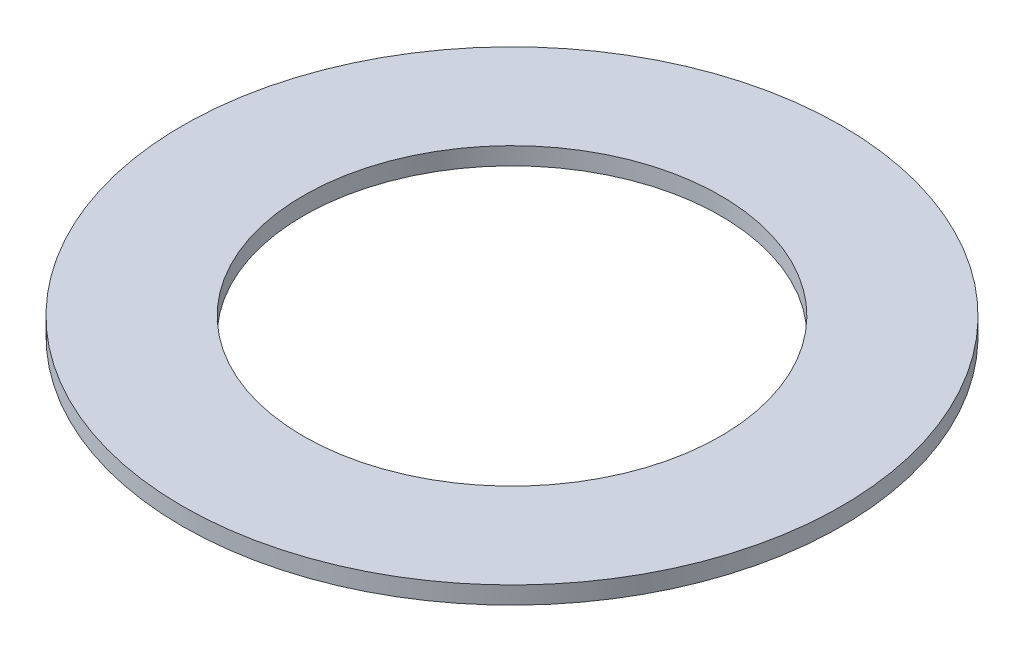
ISO-10303-21;
HEADER;
FILE_DESCRIPTION(('STEP AP214'),'2;1');
FILE_NAME('part.step','',(''),(''),'','','');
FILE_SCHEMA(('AUTOMOTIVE_DESIGN { 1 0 10303 214 1 1 1 1 }'));
ENDSEC;
DATA;
#1=APPLICATION_CONTEXT('core data for automotive mechanical design processes');
#2=APPLICATION_PROTOCOL_DEFINITION('international standard','automotive_design',2000,#1);
#3=PRODUCT_CONTEXT('',#1,'mechanical');
#4=PRODUCT('Part','Part','',(#3));
#5=PRODUCT_RELATED_PRODUCT_CATEGORY('part','',(#4));
#6=PRODUCT_DEFINITION_FORMATION('','',#4);
#7=PRODUCT_DEFINITION_CONTEXT('part definition',#1,'design');
#8=PRODUCT_DEFINITION('design','',#6,#7);
#9=PRODUCT_DEFINITION_SHAPE('','',#8);
#10=(LENGTH_UNIT() NAMED_UNIT(*) SI_UNIT(.MILLI.,.METRE.));
#11=(NAMED_UNIT(*) PLANE_ANGLE_UNIT() SI_UNIT($,.RADIAN.));
#12=(NAMED_UNIT(*) SI_UNIT($,.STERADIAN.) SOLID_ANGLE_UNIT());
#13=UNCERTAINTY_MEASURE_WITH_UNIT(LENGTH_MEASURE(1.E-05),#10,'distance_accuracy_value','');
#14=(GEOMETRIC_REPRESENTATION_CONTEXT(3) GLOBAL_UNCERTAINTY_ASSIGNED_CONTEXT((#13)) GLOBAL_UNIT_ASSIGNED_CONTEXT((#10,
#11,#12)) REPRESENTATION_CONTEXT('',''));
#15=CARTESIAN_POINT('',(0.,0.,0.));
#16=DIRECTION('',(0.,0.,1.));
#17=DIRECTION('',(1.,0.,0.));
#18=AXIS2_PLACEMENT_3D('',#15,#16,#17);
#19=CARTESIAN_POINT('',(0.,0.3,0.));
#20=DIRECTION('',(0.,1.,0.));
#21=DIRECTION('',(0.,0.,1.));
#22=AXIS2_PLACEMENT_3D('',#19,#20,#21);
#23=PLANE('',#22);
#24=CARTESIAN_POINT('',(0.,0.3,0.));
#25=DIRECTION('',(0.,1.,0.));
#26=DIRECTION('',(0.,0.,1.));
#27=AXIS2_PLACEMENT_3D('',#24,#25,#26);
#28=CIRCLE('',#27,5.65);
#29=CARTESIAN_POINT('',(0.,0.3,5.65));
#30=VERTEX_POINT('',#29);
#31=EDGE_CURVE('E10',#30,#30,#28,.T.);
#32=ORIENTED_EDGE('',*,*,#31,.T.);
#33=EDGE_LOOP('',(#32));
#34=FACE_BOUND('',#33,.T.);
#35=CARTESIAN_POINT('',(0.,0.3,0.));
#36=DIRECTION('',(0.,1.,0.));
#37=DIRECTION('',(0.,0.,1.));
#38=AXIS2_PLACEMENT_3D('',#35,#36,#37);
#39=CIRCLE('',#38,3.575);
#40=CARTESIAN_POINT('',(0.,0.3,3.575));
#41=VERTEX_POINT('',#40);
#42=EDGE_CURVE('E50',#41,#41,#39,.T.);
#43=ORIENTED_EDGE('',*,*,#42,.F.);
#44=EDGE_LOOP('',(#43));
#45=FACE_BOUND('',#44,.T.);
#46=ADVANCED_FACE('F37',(#34,#45),#23,.T.);
#47=CARTESIAN_POINT('',(0.,0.,0.));
#48=DIRECTION('',(0.,1.,0.));
#49=DIRECTION('',(0.,0.,1.));
#50=AXIS2_PLACEMENT_3D('',#47,#48,#49);
#51=PLANE('',#50);
#52=CARTESIAN_POINT('',(0.,0.,0.));
#53=DIRECTION('',(0.,1.,0.));
#54=DIRECTION('',(0.,0.,1.));
#55=AXIS2_PLACEMENT_3D('',#52,#53,#54);
#56=CIRCLE('',#55,5.65);
#57=CARTESIAN_POINT('',(0.,0.,5.65));
#58=VERTEX_POINT('',#57);
#59=EDGE_CURVE('E41',#58,#58,#56,.T.);
#60=ORIENTED_EDGE('',*,*,#59,.F.);
#61=EDGE_LOOP('',(#60));
#62=FACE_BOUND('',#61,.T.);
#63=CARTESIAN_POINT('',(0.,0.,0.));
#64=DIRECTION('',(0.,1.,0.));
#65=DIRECTION('',(0.,0.,1.));
#66=AXIS2_PLACEMENT_3D('',#63,#64,#65);
#67=CIRCLE('',#66,3.575);
#68=CARTESIAN_POINT('',(0.,0.,3.575));
#69=VERTEX_POINT('',#68);
#70=EDGE_CURVE('E52',#69,#69,#67,.T.);
#71=ORIENTED_EDGE('',*,*,#70,.T.);
#72=EDGE_LOOP('',(#71));
#73=FACE_BOUND('',#72,.T.);
#74=ADVANCED_FACE('F64',(#62,#73),#51,.F.);
#75=CARTESIAN_POINT('',(0.,0.3,0.));
#76=DIRECTION('',(0.,-1.,0.));
#77=DIRECTION('',(0.,0.,-1.));
#78=AXIS2_PLACEMENT_3D('',#75,#76,#77);
#79=CYLINDRICAL_SURFACE('',#78,5.65);
#80=ORIENTED_EDGE('',*,*,#31,.F.);
#81=EDGE_LOOP('',(#80));
#82=FACE_BOUND('',#81,.T.);
#83=ORIENTED_EDGE('',*,*,#59,.T.);
#84=EDGE_LOOP('',(#83));
#85=FACE_BOUND('',#84,.T.);
#86=ADVANCED_FACE('F39',(#82,#85),#79,.T.);
#87=CARTESIAN_POINT('',(0.,0.3,0.));
#88=DIRECTION('',(0.,-1.,0.));
#89=DIRECTION('',(0.,0.,-1.));
#90=AXIS2_PLACEMENT_3D('',#87,#88,#89);
#91=CYLINDRICAL_SURFACE('',#90,3.575);
#92=ORIENTED_EDGE('',*,*,#42,.T.);
#93=EDGE_LOOP('',(#92));
#94=FACE_BOUND('',#93,.T.);
#95=ORIENTED_EDGE('',*,*,#70,.F.);
#96=EDGE_LOOP('',(#95));
#97=FACE_BOUND('',#96,.T.);
#98=ADVANCED_FACE('F60',(#94,#97),#91,.F.);
#99=CLOSED_SHELL('',(#46,#74,#86,#98));
#100=MANIFOLD_SOLID_BREP('B2',#99);
#101=ADVANCED_BREP_SHAPE_REPRESENTATION('',(#18,#100),#14);
#102=SHAPE_DEFINITION_REPRESENTATION(#9,#101);
ENDSEC;
END-ISO-10303-21;
